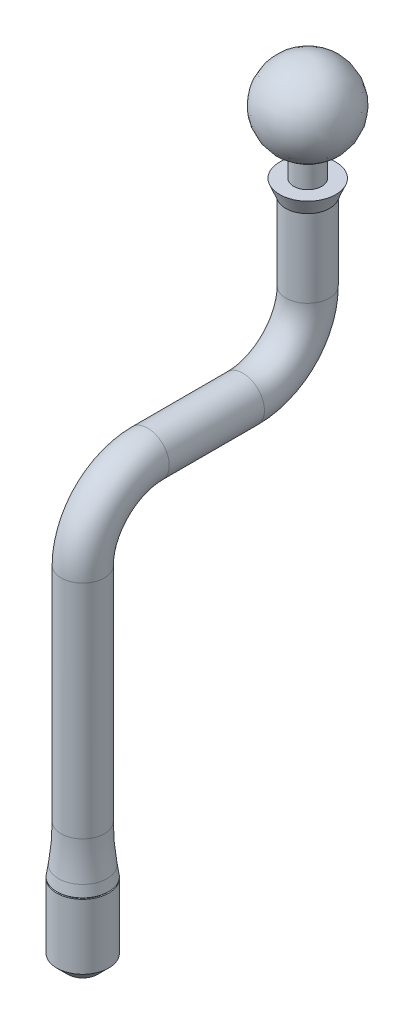
ISO-10303-21;
HEADER;
FILE_DESCRIPTION(('STEP AP214'),'2;1');
FILE_NAME('part.step','',(''),(''),'','','');
FILE_SCHEMA(('AUTOMOTIVE_DESIGN { 1 0 10303 214 1 1 1 1 }'));
ENDSEC;
DATA;
#1=APPLICATION_CONTEXT('core data for automotive mechanical design processes');
#2=APPLICATION_PROTOCOL_DEFINITION('international standard','automotive_design',2000,#1);
#3=PRODUCT_CONTEXT('',#1,'mechanical');
#4=PRODUCT('Part','Part','',(#3));
#5=PRODUCT_RELATED_PRODUCT_CATEGORY('part','',(#4));
#6=PRODUCT_DEFINITION_FORMATION('','',#4);
#7=PRODUCT_DEFINITION_CONTEXT('part definition',#1,'design');
#8=PRODUCT_DEFINITION('design','',#6,#7);
#9=PRODUCT_DEFINITION_SHAPE('','',#8);
#10=(LENGTH_UNIT() NAMED_UNIT(*) SI_UNIT(.MILLI.,.METRE.));
#11=(NAMED_UNIT(*) PLANE_ANGLE_UNIT() SI_UNIT($,.RADIAN.));
#12=(NAMED_UNIT(*) SI_UNIT($,.STERADIAN.) SOLID_ANGLE_UNIT());
#13=UNCERTAINTY_MEASURE_WITH_UNIT(LENGTH_MEASURE(1.E-05),#10,'distance_accuracy_value','');
#14=(GEOMETRIC_REPRESENTATION_CONTEXT(3) GLOBAL_UNCERTAINTY_ASSIGNED_CONTEXT((#13)) GLOBAL_UNIT_ASSIGNED_CONTEXT((#10,
#11,#12)) REPRESENTATION_CONTEXT('',''));
#15=CARTESIAN_POINT('',(0.,0.,0.));
#16=DIRECTION('',(0.,0.,1.));
#17=DIRECTION('',(1.,0.,0.));
#18=AXIS2_PLACEMENT_3D('',#15,#16,#17);
#19=CARTESIAN_POINT('',(0.,18.,0.));
#20=DIRECTION('',(0.,-1.,0.));
#21=DIRECTION('',(0.,0.,-1.));
#22=AXIS2_PLACEMENT_3D('',#19,#20,#21);
#23=PLANE('',#22);
#24=CARTESIAN_POINT('',(0.,18.,0.));
#25=DIRECTION('',(0.,-1.,0.));
#26=DIRECTION('',(0.,0.,-1.));
#27=AXIS2_PLACEMENT_3D('',#24,#25,#26);
#28=CIRCLE('',#27,2.);
#29=CARTESIAN_POINT('',(0.,18.,-2.00000000000003));
#30=VERTEX_POINT('',#29);
#31=EDGE_CURVE('E237',#30,#30,#28,.T.);
#32=ORIENTED_EDGE('',*,*,#31,.T.);
#33=EDGE_LOOP('',(#32));
#34=FACE_BOUND('',#33,.T.);
#35=ADVANCED_FACE('F51',(#34),#23,.T.);
#36=CARTESIAN_POINT('',(0.,18.,0.));
#37=DIRECTION('',(0.,-1.,0.));
#38=DIRECTION('',(0.,0.,-1.));
#39=AXIS2_PLACEMENT_3D('',#36,#37,#38);
#40=CYLINDRICAL_SURFACE('',#39,2.);
#41=CARTESIAN_POINT('',(0.,0.,0.));
#42=DIRECTION('',(0.,-1.,0.));
#43=DIRECTION('',(0.,0.,-1.));
#44=AXIS2_PLACEMENT_3D('',#41,#42,#43);
#45=CIRCLE('',#44,2.);
#46=CARTESIAN_POINT('',(0.,0.,-2.00000000000002));
#47=VERTEX_POINT('',#46);
#48=EDGE_CURVE('E245',#47,#47,#45,.T.);
#49=ORIENTED_EDGE('',*,*,#48,.T.);
#50=EDGE_LOOP('',(#49));
#51=FACE_BOUND('',#50,.T.);
#52=ORIENTED_EDGE('',*,*,#31,.F.);
#53=EDGE_LOOP('',(#52));
#54=FACE_BOUND('',#53,.T.);
#55=ADVANCED_FACE('F210',(#51,#54),#40,.F.);
#56=CARTESIAN_POINT('',(0.,0.,15.));
#57=DIRECTION('',(-1.,0.,0.));
#58=DIRECTION('',(0.,0.,1.));
#59=AXIS2_PLACEMENT_3D('',#56,#57,#58);
#60=TOROIDAL_SURFACE('',#59,15.,2.);
#61=CARTESIAN_POINT('',(0.,-15.,15.));
#62=DIRECTION('',(0.,0.,1.));
#63=DIRECTION('',(0.,-1.,0.));
#64=AXIS2_PLACEMENT_3D('',#61,#62,#63);
#65=CIRCLE('',#64,2.);
#66=CARTESIAN_POINT('',(0.,-17.,15.));
#67=VERTEX_POINT('',#66);
#68=EDGE_CURVE('E242',#67,#67,#65,.T.);
#69=CARTESIAN_POINT('',(0.,0.,15.));
#70=DIRECTION('',(-1.,0.,0.));
#71=DIRECTION('',(0.,0.,1.));
#72=AXIS2_PLACEMENT_3D('',#69,#70,#71);
#73=CIRCLE('',#72,17.);
#74=EDGE_CURVE('',#47,#67,#73,.T.);
#75=ORIENTED_EDGE('',*,*,#48,.F.);
#76=ORIENTED_EDGE('',*,*,#68,.T.);
#77=ORIENTED_EDGE('',*,*,#74,.T.);
#78=ORIENTED_EDGE('',*,*,#74,.F.);
#79=EDGE_LOOP('',(#75,#77,#76,#78));
#80=FACE_BOUND('',#79,.T.);
#81=ADVANCED_FACE('F330',(#80),#60,.F.);
#82=CARTESIAN_POINT('',(0.,-15.,15.));
#83=DIRECTION('',(0.,0.,1.));
#84=DIRECTION('',(1.,0.,0.));
#85=AXIS2_PLACEMENT_3D('',#82,#83,#84);
#86=CYLINDRICAL_SURFACE('',#85,2.);
#87=CARTESIAN_POINT('',(0.,-15.,37.));
#88=DIRECTION('',(0.,0.,1.));
#89=DIRECTION('',(0.,-1.,0.));
#90=AXIS2_PLACEMENT_3D('',#87,#88,#89);
#91=CIRCLE('',#90,2.);
#92=CARTESIAN_POINT('',(0.,-13.,37.));
#93=VERTEX_POINT('',#92);
#94=EDGE_CURVE('E233',#93,#93,#91,.T.);
#95=ORIENTED_EDGE('',*,*,#94,.T.);
#96=EDGE_LOOP('',(#95));
#97=FACE_BOUND('',#96,.T.);
#98=ORIENTED_EDGE('',*,*,#68,.F.);
#99=EDGE_LOOP('',(#98));
#100=FACE_BOUND('',#99,.T.);
#101=ADVANCED_FACE('F201',(#97,#100),#86,.F.);
#102=CARTESIAN_POINT('',(0.,-30.,37.));
#103=DIRECTION('',(1.,0.,0.));
#104=DIRECTION('',(0.,0.,-1.));
#105=AXIS2_PLACEMENT_3D('',#102,#103,#104);
#106=TOROIDAL_SURFACE('',#105,15.,2.);
#107=CARTESIAN_POINT('',(0.,-30.,52.));
#108=DIRECTION('',(0.,-1.,0.));
#109=DIRECTION('',(0.,0.,-1.));
#110=AXIS2_PLACEMENT_3D('',#107,#108,#109);
#111=CIRCLE('',#110,2.);
#112=CARTESIAN_POINT('',(0.,-30.,54.));
#113=VERTEX_POINT('',#112);
#114=EDGE_CURVE('E229',#113,#113,#111,.T.);
#115=CARTESIAN_POINT('',(0.,-30.,37.));
#116=DIRECTION('',(1.,0.,0.));
#117=DIRECTION('',(0.,0.,-1.));
#118=AXIS2_PLACEMENT_3D('',#115,#116,#117);
#119=CIRCLE('',#118,17.);
#120=EDGE_CURVE('',#93,#113,#119,.T.);
#121=ORIENTED_EDGE('',*,*,#94,.F.);
#122=ORIENTED_EDGE('',*,*,#114,.T.);
#123=ORIENTED_EDGE('',*,*,#120,.T.);
#124=ORIENTED_EDGE('',*,*,#120,.F.);
#125=EDGE_LOOP('',(#121,#123,#122,#124));
#126=FACE_BOUND('',#125,.T.);
#127=ADVANCED_FACE('F191',(#126),#106,.F.);
#128=CARTESIAN_POINT('',(0.,-30.,52.));
#129=DIRECTION('',(0.,-1.,0.));
#130=DIRECTION('',(0.,0.,-1.));
#131=AXIS2_PLACEMENT_3D('',#128,#129,#130);
#132=CYLINDRICAL_SURFACE('',#131,2.);
#133=CARTESIAN_POINT('',(0.,-92.3,52.));
#134=DIRECTION('',(0.,-1.,0.));
#135=DIRECTION('',(0.,0.,-1.));
#136=AXIS2_PLACEMENT_3D('',#133,#134,#135);
#137=CIRCLE('',#136,2.);
#138=CARTESIAN_POINT('',(0.,-92.3,50.));
#139=VERTEX_POINT('',#138);
#140=EDGE_CURVE('E236',#139,#139,#137,.T.);
#141=ORIENTED_EDGE('',*,*,#140,.T.);
#142=EDGE_LOOP('',(#141));
#143=FACE_BOUND('',#142,.T.);
#144=ORIENTED_EDGE('',*,*,#114,.F.);
#145=EDGE_LOOP('',(#144));
#146=FACE_BOUND('',#145,.T.);
#147=ADVANCED_FACE('F188',(#143,#146),#132,.F.);
#148=CARTESIAN_POINT('',(0.,-92.3,52.));
#149=DIRECTION('',(0.,1.,0.));
#150=DIRECTION('',(0.,0.,1.));
#151=AXIS2_PLACEMENT_3D('',#148,#149,#150);
#152=PLANE('',#151);
#153=CARTESIAN_POINT('',(0.,-92.3,52.));
#154=DIRECTION('',(0.,-1.,0.));
#155=DIRECTION('',(0.,0.,-1.));
#156=AXIS2_PLACEMENT_3D('',#153,#154,#155);
#157=CIRCLE('',#156,2.73052333998283);
#158=CARTESIAN_POINT('',(0.,-92.3,49.2694766600171));
#159=VERTEX_POINT('',#158);
#160=EDGE_CURVE('E238',#159,#159,#157,.T.);
#161=ORIENTED_EDGE('',*,*,#160,.T.);
#162=EDGE_LOOP('',(#161));
#163=FACE_BOUND('',#162,.T.);
#164=ORIENTED_EDGE('',*,*,#140,.F.);
#165=EDGE_LOOP('',(#164));
#166=FACE_BOUND('',#165,.T.);
#167=ADVANCED_FACE('F190',(#163,#166),#152,.F.);
#168=CARTESIAN_POINT('',(0.,-110.1,52.));
#169=DIRECTION('',(0.,-1.,0.));
#170=DIRECTION('',(0.,0.,-1.));
#171=AXIS2_PLACEMENT_3D('',#168,#169,#170);
#172=CYLINDRICAL_SURFACE('',#171,2.73052333998283);
#173=ORIENTED_EDGE('',*,*,#160,.F.);
#174=EDGE_LOOP('',(#173));
#175=FACE_BOUND('',#174,.T.);
#176=CARTESIAN_POINT('',(0.,-95.7274244285848,52.));
#177=DIRECTION('',(0.,-1.,0.));
#178=DIRECTION('',(0.,0.,-1.));
#179=AXIS2_PLACEMENT_3D('',#176,#177,#178);
#180=CIRCLE('',#179,2.73052333998283);
#181=CARTESIAN_POINT('',(0.,-95.7274244285848,49.2694766600171));
#182=VERTEX_POINT('',#181);
#183=EDGE_CURVE('E252',#182,#182,#180,.T.);
#184=ORIENTED_EDGE('',*,*,#183,.T.);
#185=EDGE_LOOP('',(#184));
#186=FACE_BOUND('',#185,.T.);
#187=ADVANCED_FACE('F198',(#175,#186),#172,.F.);
#188=CARTESIAN_POINT('',(0.,-95.7274244285848,49.2694766600171));
#189=DIRECTION('',(0.,1.,0.));
#190=DIRECTION('',(0.,0.,1.));
#191=AXIS2_PLACEMENT_3D('',#188,#189,#190);
#192=PLANE('',#191);
#193=ORIENTED_EDGE('',*,*,#183,.F.);
#194=EDGE_LOOP('',(#193));
#195=FACE_BOUND('',#194,.T.);
#196=CARTESIAN_POINT('',(0.,-95.7274244285848,52.));
#197=DIRECTION('',(0.,-1.,0.));
#198=DIRECTION('',(0.,0.,-1.));
#199=AXIS2_PLACEMENT_3D('',#196,#197,#198);
#200=CIRCLE('',#199,5.19254816156816);
#201=CARTESIAN_POINT('',(0.,-95.7274244285848,46.8074518384318));
#202=VERTEX_POINT('',#201);
#203=EDGE_CURVE('E255',#202,#202,#200,.T.);
#204=ORIENTED_EDGE('',*,*,#203,.T.);
#205=EDGE_LOOP('',(#204));
#206=FACE_BOUND('',#205,.T.);
#207=ADVANCED_FACE('F373',(#195,#206),#192,.F.);
#208=CARTESIAN_POINT('',(0.,-110.1,52.));
#209=DIRECTION('',(0.,-1.,0.));
#210=DIRECTION('',(0.,0.,-1.));
#211=AXIS2_PLACEMENT_3D('',#208,#209,#210);
#212=CYLINDRICAL_SURFACE('',#211,5.19254816156816);
#213=ORIENTED_EDGE('',*,*,#203,.F.);
#214=EDGE_LOOP('',(#213));
#215=FACE_BOUND('',#214,.T.);
#216=CARTESIAN_POINT('',(0.,-107.137770340873,52.));
#217=DIRECTION('',(0.,-1.,0.));
#218=DIRECTION('',(0.,0.,-1.));
#219=AXIS2_PLACEMENT_3D('',#216,#217,#218);
#220=CIRCLE('',#219,5.19254816156816);
#221=CARTESIAN_POINT('',(0.,-107.137770340873,46.8074518384318));
#222=VERTEX_POINT('',#221);
#223=EDGE_CURVE('E258',#222,#222,#220,.T.);
#224=ORIENTED_EDGE('',*,*,#223,.T.);
#225=EDGE_LOOP('',(#224));
#226=FACE_BOUND('',#225,.T.);
#227=ADVANCED_FACE('F383',(#215,#226),#212,.F.);
#228=CARTESIAN_POINT('',(0.,-109.670285322917,52.));
#229=DIRECTION('',(0.,1.,0.));
#230=DIRECTION('',(0.,0.,1.));
#231=AXIS2_PLACEMENT_3D('',#228,#229,#230);
#232=CONICAL_SURFACE('',#231,2.66003317952349,0.785398163397447);
#233=ORIENTED_EDGE('',*,*,#223,.F.);
#234=EDGE_LOOP('',(#233));
#235=FACE_BOUND('',#234,.T.);
#236=CARTESIAN_POINT('',(0.,-109.670285322917,52.));
#237=DIRECTION('',(0.,-1.,0.));
#238=DIRECTION('',(0.,0.,-1.));
#239=AXIS2_PLACEMENT_3D('',#236,#237,#238);
#240=CIRCLE('',#239,2.66003317952349);
#241=CARTESIAN_POINT('',(0.,-109.670285322917,49.3399668204765));
#242=VERTEX_POINT('',#241);
#243=EDGE_CURVE('E261',#242,#242,#240,.T.);
#244=ORIENTED_EDGE('',*,*,#243,.T.);
#245=EDGE_LOOP('',(#244));
#246=FACE_BOUND('',#245,.T.);
#247=ADVANCED_FACE('F393',(#235,#246),#232,.F.);
#248=CARTESIAN_POINT('',(0.,-109.670285322917,49.3399668204765));
#249=DIRECTION('',(0.,-1.,0.));
#250=DIRECTION('',(0.,0.,-1.));
#251=AXIS2_PLACEMENT_3D('',#248,#249,#250);
#252=PLANE('',#251);
#253=ORIENTED_EDGE('',*,*,#243,.F.);
#254=EDGE_LOOP('',(#253));
#255=FACE_BOUND('',#254,.T.);
#256=CARTESIAN_POINT('',(0.,-109.670285322917,52.));
#257=DIRECTION('',(0.,-1.,0.));
#258=DIRECTION('',(0.,0.,-1.));
#259=AXIS2_PLACEMENT_3D('',#256,#257,#258);
#260=CIRCLE('',#259,0.750000000000001);
#261=CARTESIAN_POINT('',(0.,-109.670285322917,51.25));
#262=VERTEX_POINT('',#261);
#263=EDGE_CURVE('E264',#262,#262,#260,.T.);
#264=ORIENTED_EDGE('',*,*,#263,.T.);
#265=EDGE_LOOP('',(#264));
#266=FACE_BOUND('',#265,.T.);
#267=ADVANCED_FACE('F403',(#255,#266),#252,.F.);
#268=CARTESIAN_POINT('',(0.,-110.1,52.));
#269=DIRECTION('',(0.,-1.,0.));
#270=DIRECTION('',(0.,0.,-1.));
#271=AXIS2_PLACEMENT_3D('',#268,#269,#270);
#272=CYLINDRICAL_SURFACE('',#271,0.750000000000001);
#273=ORIENTED_EDGE('',*,*,#263,.F.);
#274=EDGE_LOOP('',(#273));
#275=FACE_BOUND('',#274,.T.);
#276=CARTESIAN_POINT('',(0.,-110.1,52.));
#277=DIRECTION('',(0.,-1.,0.));
#278=DIRECTION('',(0.,0.,-1.));
#279=AXIS2_PLACEMENT_3D('',#276,#277,#278);
#280=CIRCLE('',#279,0.750000000000001);
#281=CARTESIAN_POINT('',(0.,-110.1,51.25));
#282=VERTEX_POINT('',#281);
#283=EDGE_CURVE('E267',#282,#282,#280,.T.);
#284=ORIENTED_EDGE('',*,*,#283,.T.);
#285=EDGE_LOOP('',(#284));
#286=FACE_BOUND('',#285,.T.);
#287=ADVANCED_FACE('F271',(#275,#286),#272,.F.);
#288=CARTESIAN_POINT('',(0.,18.,0.));
#289=DIRECTION('',(0.,-1.,0.));
#290=DIRECTION('',(0.,0.,-1.));
#291=AXIS2_PLACEMENT_3D('',#288,#289,#290);
#292=CYLINDRICAL_SURFACE('',#291,5.);
#293=CARTESIAN_POINT('',(0.,0.,0.));
#294=DIRECTION('',(0.,1.,0.));
#295=DIRECTION('',(0.,0.,1.));
#296=AXIS2_PLACEMENT_3D('',#293,#294,#295);
#297=CIRCLE('',#296,5.);
#298=CARTESIAN_POINT('',(0.,0.,-5.));
#299=VERTEX_POINT('',#298);
#300=EDGE_CURVE('E162',#299,#299,#297,.T.);
#301=ORIENTED_EDGE('',*,*,#300,.T.);
#302=EDGE_LOOP('',(#301));
#303=FACE_BOUND('',#302,.T.);
#304=CARTESIAN_POINT('',(0.,18.,0.));
#305=DIRECTION('',(0.,1.,0.));
#306=DIRECTION('',(0.,0.,1.));
#307=AXIS2_PLACEMENT_3D('',#304,#305,#306);
#308=CIRCLE('',#307,5.);
#309=CARTESIAN_POINT('',(0.,18.,4.99999999999999));
#310=VERTEX_POINT('',#309);
#311=EDGE_CURVE('E156',#310,#310,#308,.T.);
#312=ORIENTED_EDGE('',*,*,#311,.F.);
#313=EDGE_LOOP('',(#312));
#314=FACE_BOUND('',#313,.T.);
#315=ADVANCED_FACE('F420',(#303,#314),#292,.T.);
#316=CARTESIAN_POINT('',(0.,0.,15.));
#317=DIRECTION('',(-1.,0.,0.));
#318=DIRECTION('',(0.,0.,1.));
#319=AXIS2_PLACEMENT_3D('',#316,#317,#318);
#320=TOROIDAL_SURFACE('',#319,15.,5.);
#321=CARTESIAN_POINT('',(0.,-15.,15.));
#322=DIRECTION('',(0.,0.,-1.));
#323=DIRECTION('',(0.,1.,0.));
#324=AXIS2_PLACEMENT_3D('',#321,#322,#323);
#325=CIRCLE('',#324,5.);
#326=CARTESIAN_POINT('',(0.,-20.,15.));
#327=VERTEX_POINT('',#326);
#328=EDGE_CURVE('E165',#327,#327,#325,.T.);
#329=CARTESIAN_POINT('',(0.,0.,15.));
#330=DIRECTION('',(-1.,0.,0.));
#331=DIRECTION('',(0.,0.,1.));
#332=AXIS2_PLACEMENT_3D('',#329,#330,#331);
#333=CIRCLE('',#332,20.);
#334=EDGE_CURVE('',#299,#327,#333,.T.);
#335=ORIENTED_EDGE('',*,*,#300,.F.);
#336=ORIENTED_EDGE('',*,*,#328,.T.);
#337=ORIENTED_EDGE('',*,*,#334,.T.);
#338=ORIENTED_EDGE('',*,*,#334,.F.);
#339=EDGE_LOOP('',(#335,#337,#336,#338));
#340=FACE_BOUND('',#339,.T.);
#341=ADVANCED_FACE('F430',(#340),#320,.T.);
#342=CARTESIAN_POINT('',(0.,-15.,15.));
#343=DIRECTION('',(0.,0.,1.));
#344=DIRECTION('',(1.,0.,0.));
#345=AXIS2_PLACEMENT_3D('',#342,#343,#344);
#346=CYLINDRICAL_SURFACE('',#345,5.);
#347=CARTESIAN_POINT('',(0.,-15.,37.));
#348=DIRECTION('',(0.,0.,-1.));
#349=DIRECTION('',(0.,1.,0.));
#350=AXIS2_PLACEMENT_3D('',#347,#348,#349);
#351=CIRCLE('',#350,5.);
#352=CARTESIAN_POINT('',(0.,-10.,37.));
#353=VERTEX_POINT('',#352);
#354=EDGE_CURVE('E168',#353,#353,#351,.T.);
#355=ORIENTED_EDGE('',*,*,#354,.T.);
#356=EDGE_LOOP('',(#355));
#357=FACE_BOUND('',#356,.T.);
#358=ORIENTED_EDGE('',*,*,#328,.F.);
#359=EDGE_LOOP('',(#358));
#360=FACE_BOUND('',#359,.T.);
#361=ADVANCED_FACE('F437',(#357,#360),#346,.T.);
#362=CARTESIAN_POINT('',(0.,-30.,37.));
#363=DIRECTION('',(1.,0.,0.));
#364=DIRECTION('',(0.,0.,-1.));
#365=AXIS2_PLACEMENT_3D('',#362,#363,#364);
#366=TOROIDAL_SURFACE('',#365,15.,5.);
#367=CARTESIAN_POINT('',(0.,-30.,52.));
#368=DIRECTION('',(0.,1.,0.));
#369=DIRECTION('',(0.,0.,1.));
#370=AXIS2_PLACEMENT_3D('',#367,#368,#369);
#371=CIRCLE('',#370,5.);
#372=CARTESIAN_POINT('',(0.,-30.,57.));
#373=VERTEX_POINT('',#372);
#374=EDGE_CURVE('E171',#373,#373,#371,.T.);
#375=CARTESIAN_POINT('',(0.,-30.,37.));
#376=DIRECTION('',(1.,0.,0.));
#377=DIRECTION('',(0.,0.,-1.));
#378=AXIS2_PLACEMENT_3D('',#375,#376,#377);
#379=CIRCLE('',#378,20.);
#380=EDGE_CURVE('',#353,#373,#379,.T.);
#381=ORIENTED_EDGE('',*,*,#354,.F.);
#382=ORIENTED_EDGE('',*,*,#374,.T.);
#383=ORIENTED_EDGE('',*,*,#380,.T.);
#384=ORIENTED_EDGE('',*,*,#380,.F.);
#385=EDGE_LOOP('',(#381,#383,#382,#384));
#386=FACE_BOUND('',#385,.T.);
#387=ADVANCED_FACE('F445',(#386),#366,.T.);
#388=CARTESIAN_POINT('',(0.,-30.,52.));
#389=DIRECTION('',(0.,-1.,0.));
#390=DIRECTION('',(0.,0.,-1.));
#391=AXIS2_PLACEMENT_3D('',#388,#389,#390);
#392=CYLINDRICAL_SURFACE('',#391,5.);
#393=CARTESIAN_POINT('',(0.,-81.2074927859557,52.));
#394=DIRECTION('',(0.,-1.,0.));
#395=DIRECTION('',(0.,0.,-1.));
#396=AXIS2_PLACEMENT_3D('',#393,#394,#395);
#397=CIRCLE('',#396,5.);
#398=CARTESIAN_POINT('',(0.,-81.2074927859557,47.));
#399=VERTEX_POINT('',#398);
#400=EDGE_CURVE('E59',#399,#399,#397,.F.);
#401=ORIENTED_EDGE('',*,*,#400,.T.);
#402=EDGE_LOOP('',(#401));
#403=FACE_BOUND('',#402,.T.);
#404=ORIENTED_EDGE('',*,*,#374,.F.);
#405=EDGE_LOOP('',(#404));
#406=FACE_BOUND('',#405,.T.);
#407=ADVANCED_FACE('F179',(#403,#406),#392,.T.);
#408=CARTESIAN_POINT('',(0.,-92.3,52.));
#409=DIRECTION('',(0.,-1.,0.));
#410=DIRECTION('',(0.,0.,-1.));
#411=AXIS2_PLACEMENT_3D('',#408,#409,#410);
#412=PLANE('',#411);
#413=CARTESIAN_POINT('',(0.,-92.3,52.));
#414=DIRECTION('',(0.,-1.,0.));
#415=DIRECTION('',(0.,0.,-1.));
#416=AXIS2_PLACEMENT_3D('',#413,#414,#415);
#417=CIRCLE('',#416,5.7);
#418=CARTESIAN_POINT('',(0.,-92.3,46.3));
#419=VERTEX_POINT('',#418);
#420=EDGE_CURVE('E12',#419,#419,#417,.T.);
#421=ORIENTED_EDGE('',*,*,#420,.F.);
#422=EDGE_LOOP('',(#421));
#423=FACE_BOUND('',#422,.T.);
#424=CARTESIAN_POINT('',(0.,-92.3,52.));
#425=DIRECTION('',(0.,-1.,0.));
#426=DIRECTION('',(0.,0.,-1.));
#427=AXIS2_PLACEMENT_3D('',#424,#425,#426);
#428=CIRCLE('',#427,6.);
#429=CARTESIAN_POINT('',(1.52050741507945,-92.3,46.1958586164112));
#430=VERTEX_POINT('',#429);
#431=EDGE_CURVE('E146',#430,#430,#428,.T.);
#432=ORIENTED_EDGE('',*,*,#431,.T.);
#433=EDGE_LOOP('',(#432));
#434=FACE_BOUND('',#433,.T.);
#435=ADVANCED_FACE('F123',(#423,#434),#412,.T.);
#436=CARTESIAN_POINT('',(0.,-85.,47.));
#437=CARTESIAN_POINT('',(1.52050741507945,-92.3,46.1958586164112));
#438=CARTESIAN_POINT('',(10.,-85.,47.));
#439=CARTESIAN_POINT('',(13.1287901822571,-92.3,49.2368734465701));
#440=CARTESIAN_POINT('',(10.,-85.,57.));
#441=CARTESIAN_POINT('',(10.0877753520982,-92.3,60.8451562137477));
#442=CARTESIAN_POINT('',(0.,-85.,57.));
#443=CARTESIAN_POINT('',(-1.52050741507945,-92.3,57.8041413835888));
#444=CARTESIAN_POINT('',(-10.,-85.,57.));
#445=CARTESIAN_POINT('',(-13.1287901822571,-92.3,54.7631265534299));
#446=CARTESIAN_POINT('',(-10.,-85.,47.));
#447=CARTESIAN_POINT('',(-10.0877753520982,-92.3,43.1548437862522));
#448=CARTESIAN_POINT('',(0.,-85.,47.));
#449=CARTESIAN_POINT('',(1.52050741507945,-92.3,46.1958586164112));
#450=(BOUNDED_SURFACE() B_SPLINE_SURFACE(3,1,((#436,#437),(#438,#439),(#440,#441),(#442,#443),
(#444,#445),(#446,#447),(#448,#449)),.UNSPECIFIED.,.T.,.F.,.F.) B_SPLINE_SURFACE_WITH_KNOTS((4,
3,4),(2,2),(0.,0.5,1.),(0.,1.),
.UNSPECIFIED.) GEOMETRIC_REPRESENTATION_ITEM() RATIONAL_B_SPLINE_SURFACE(((1.,1.),
(0.333333333333333,0.333333333333333),(0.333333333333333,0.333333333333333),(1.,1.),
(0.333333333333333,0.333333333333333),(0.333333333333333,0.333333333333333),(1.,1.))) REPRESENTATION_ITEM('') SURFACE());
#451=CARTESIAN_POINT('',(0.,-89.8687351518546,52.));
#452=DIRECTION('',(0.,-1.,0.));
#453=DIRECTION('',(0.,0.,-1.));
#454=AXIS2_PLACEMENT_3D('',#451,#452,#453);
#455=CIRCLE('',#454,5.62843373567481);
#456=CARTESIAN_POINT('',(1.01410245211684,-89.8687351518546,46.4636778874877));
#457=VERTEX_POINT('',#456);
#458=EDGE_CURVE('E174',#457,#457,#455,.T.);
#459=CARTESIAN_POINT('',(1.01410245211684,-89.8687351518546,46.4636778874877));
#460=CARTESIAN_POINT('',(1.01937750381436,-89.8940608273561,46.4608881034139));
#461=CARTESIAN_POINT('',(1.02465255551189,-89.9193865028576,46.4580983193402));
#462=CARTESIAN_POINT('',(1.03520265890695,-89.9700378538606,46.4525187511928));
#463=CARTESIAN_POINT('',(1.04047771060448,-89.9953635293622,46.4497289671191));
#464=CARTESIAN_POINT('',(1.05102781399953,-90.0460148803652,46.4441493989717));
#465=CARTESIAN_POINT('',(1.05630286569706,-90.0713405558667,46.4413596148979));
#466=CARTESIAN_POINT('',(1.06685296909211,-90.1219919068697,46.4357800467505));
#467=CARTESIAN_POINT('',(1.07212802078964,-90.1473175823713,46.4329902626768));
#468=CARTESIAN_POINT('',(1.08267812418469,-90.1979689333743,46.4274106945294));
#469=CARTESIAN_POINT('',(1.08795317588222,-90.2232946088758,46.4246209104557));
#470=CARTESIAN_POINT('',(1.09850327927727,-90.2739459598788,46.4190413423082));
#471=CARTESIAN_POINT('',(1.1037783309748,-90.2992716353804,46.4162515582345));
#472=CARTESIAN_POINT('',(1.11432843436986,-90.3499229863834,46.4106719900871));
#473=CARTESIAN_POINT('',(1.11960348606738,-90.3752486618849,46.4078822060134));
#474=CARTESIAN_POINT('',(1.13015358946244,-90.4259000128879,46.402302637866));
#475=CARTESIAN_POINT('',(1.13542864115997,-90.4512256883894,46.3995128537922));
#476=CARTESIAN_POINT('',(1.14597874455502,-90.5018770393925,46.3939332856448));
#477=CARTESIAN_POINT('',(1.15125379625255,-90.527202714894,46.3911435015711));
#478=CARTESIAN_POINT('',(1.1618038996476,-90.577854065897,46.3855639334237));
#479=CARTESIAN_POINT('',(1.16707895134513,-90.6031797413985,46.38277414935));
#480=CARTESIAN_POINT('',(1.17762905474018,-90.6538310924015,46.3771945812025));
#481=CARTESIAN_POINT('',(1.18290410643771,-90.6791567679031,46.3744047971288));
#482=CARTESIAN_POINT('',(1.19345420983277,-90.7298081189061,46.3688252289814));
#483=CARTESIAN_POINT('',(1.19872926153029,-90.7551337944076,46.3660354449077));
#484=CARTESIAN_POINT('',(1.20927936492535,-90.8057851454106,46.3604558767603));
#485=CARTESIAN_POINT('',(1.21455441662287,-90.8311108209121,46.3576660926865));
#486=CARTESIAN_POINT('',(1.22510452001793,-90.8817621719152,46.3520865245391));
#487=CARTESIAN_POINT('',(1.23037957171546,-90.9070878474167,46.3492967404654));
#488=CARTESIAN_POINT('',(1.24092967511051,-90.9577391984197,46.343717172318));
#489=CARTESIAN_POINT('',(1.24620472680804,-90.9830648739212,46.3409273882443));
#490=CARTESIAN_POINT('',(1.25675483020309,-91.0337162249243,46.3353478200968));
#491=CARTESIAN_POINT('',(1.26202988190062,-91.0590419004258,46.3325580360231));
#492=CARTESIAN_POINT('',(1.27257998529567,-91.1096932514288,46.3269784678757));
#493=CARTESIAN_POINT('',(1.2778550369932,-91.1350189269303,46.324188683802));
#494=CARTESIAN_POINT('',(1.28840514038826,-91.1856702779334,46.3186091156545));
#495=CARTESIAN_POINT('',(1.29368019208578,-91.2109959534349,46.3158193315808));
#496=CARTESIAN_POINT('',(1.30423029548084,-91.2616473044379,46.3102397634334));
#497=CARTESIAN_POINT('',(1.30950534717836,-91.2869729799394,46.3074499793597));
#498=CARTESIAN_POINT('',(1.32005545057342,-91.3376243309424,46.3018704112123));
#499=CARTESIAN_POINT('',(1.32533050227095,-91.362950006444,46.2990806271386));
#500=CARTESIAN_POINT('',(1.335880605666,-91.413601357447,46.2935010589911));
#501=CARTESIAN_POINT('',(1.34115565736353,-91.4389270329485,46.2907112749174));
#502=CARTESIAN_POINT('',(1.35170576075858,-91.4895783839515,46.28513170677));
#503=CARTESIAN_POINT('',(1.35698081245611,-91.514904059453,46.2823419226963));
#504=CARTESIAN_POINT('',(1.36753091585116,-91.5655554104561,46.2767623545489));
#505=CARTESIAN_POINT('',(1.37280596754869,-91.5908810859576,46.2739725704751));
#506=CARTESIAN_POINT('',(1.38335607094375,-91.6415324369606,46.2683930023277));
#507=CARTESIAN_POINT('',(1.38863112264127,-91.6668581124621,46.265603218254));
#508=CARTESIAN_POINT('',(1.39918122603633,-91.7175094634652,46.2600236501066));
#509=CARTESIAN_POINT('',(1.40445627773386,-91.7428351389667,46.2572338660328));
#510=CARTESIAN_POINT('',(1.41500638112891,-91.7934864899697,46.2516542978854));
#511=CARTESIAN_POINT('',(1.42028143282644,-91.8188121654712,46.2488645138117));
#512=CARTESIAN_POINT('',(1.43083153622149,-91.8694635164743,46.2432849456643));
#513=CARTESIAN_POINT('',(1.43610658791902,-91.8947891919758,46.2404951615906));
#514=CARTESIAN_POINT('',(1.44665669131407,-91.9454405429788,46.2349155934431));
#515=CARTESIAN_POINT('',(1.4519317430116,-91.9707662184803,46.2321258093694));
#516=CARTESIAN_POINT('',(1.46248184640665,-92.0214175694833,46.226546241222));
#517=CARTESIAN_POINT('',(1.46775689810418,-92.0467432449849,46.2237564571483));
#518=CARTESIAN_POINT('',(1.47830700149924,-92.0973945959879,46.2181768890009));
#519=CARTESIAN_POINT('',(1.48358205319676,-92.1227202714894,46.2153871049271));
#520=CARTESIAN_POINT('',(1.49413215659182,-92.1733716224924,46.2098075367797));
#521=CARTESIAN_POINT('',(1.49940720828935,-92.1986972979939,46.207017752706));
#522=CARTESIAN_POINT('',(1.5099573116844,-92.249348648997,46.2014381845586));
#523=CARTESIAN_POINT('',(1.51523236338193,-92.2746743244985,46.1986484004849));
#524=CARTESIAN_POINT('',(1.52050741507945,-92.3,46.1958586164112));
#525=B_SPLINE_CURVE_WITH_KNOTS('',3,(#459,#460,#461,#462,#463,#464,#465,#466,#467,#468,#469,
#470,#471,#472,#473,#474,#475,#476,#477,#478,#479,#480,#481,#482,#483,#484,#485,#486,#487,#488,
#489,#490,#491,#492,#493,#494,#495,#496,#497,#498,#499,#500,#501,#502,#503,#504,#505,#506,#507,
#508,#509,#510,#511,#512,#513,#514,#515,#516,#517,#518,#519,#520,#521,#522,#523,#524),
.UNSPECIFIED.,.F.,.F.,(4,2,2,2,2,2,2,2,2,2,2,2,2,2,2,2,2,2,2,2,2,2,2,2,2,2,2,2,2,2,2,2,4),(0.,
0.0780576078725021,0.156115215745004,0.23417282361752,0.312230431490009,0.390288039362537,
0.468345647235026,0.546403255107541,0.624460862980043,0.702518470852545,0.78057607872506,
0.858633686597562,0.936691294470064,1.01474890234257,1.09280651021507,1.17086411808758,
1.24892172596009,1.32697933383259,1.4050369417051,1.48309454957761,1.56115215745011,
1.63920976532261,1.71726737319514,1.79532498106763,1.87338258894014,1.95144019681264,
2.02949780468516,2.10755541255766,2.18561302043016,2.26367062830267,2.34172823617517,
2.41978584404768,2.49784345192018),.UNSPECIFIED.);
#526=EDGE_CURVE('BSEAM117',#457,#430,#525,.T.);
#527=ORIENTED_EDGE('',*,*,#458,.T.);
#528=ORIENTED_EDGE('',*,*,#431,.F.);
#529=ORIENTED_EDGE('',*,*,#526,.T.);
#530=ORIENTED_EDGE('',*,*,#526,.F.);
#531=EDGE_LOOP('',(#527,#529,#528,#530));
#532=FACE_BOUND('',#531,.T.);
#533=ADVANCED_FACE('F117',(#532),#450,.T.);
#534=CARTESIAN_POINT('',(0.,-81.2074927859557,52.));
#535=DIRECTION('',(0.,-1.,0.));
#536=DIRECTION('',(0.,0.,-1.));
#537=AXIS2_PLACEMENT_3D('',#534,#535,#536);
#538=TOROIDAL_SURFACE('',#537,65.,60.);
#539=ORIENTED_EDGE('',*,*,#400,.F.);
#540=EDGE_LOOP('',(#539));
#541=FACE_BOUND('',#540,.T.);
#542=ORIENTED_EDGE('',*,*,#458,.F.);
#543=EDGE_LOOP('',(#542));
#544=FACE_BOUND('',#543,.T.);
#545=ADVANCED_FACE('F53',(#541,#544),#538,.F.);
#546=CARTESIAN_POINT('',(0.,-92.6,52.));
#547=DIRECTION('',(0.,1.,0.));
#548=DIRECTION('',(0.,0.,1.));
#549=AXIS2_PLACEMENT_3D('',#546,#547,#548);
#550=CYLINDRICAL_SURFACE('',#549,5.7);
#551=CARTESIAN_POINT('',(0.,-92.6,52.));
#552=DIRECTION('',(0.,-1.,0.));
#553=DIRECTION('',(0.,0.,-1.));
#554=AXIS2_PLACEMENT_3D('',#551,#552,#553);
#555=CIRCLE('',#554,5.7);
#556=CARTESIAN_POINT('',(0.,-92.6,46.3));
#557=VERTEX_POINT('',#556);
#558=EDGE_CURVE('E157',#557,#557,#555,.T.);
#559=ORIENTED_EDGE('',*,*,#558,.F.);
#560=EDGE_LOOP('',(#559));
#561=FACE_BOUND('',#560,.T.);
#562=ORIENTED_EDGE('',*,*,#420,.T.);
#563=EDGE_LOOP('',(#562));
#564=FACE_BOUND('',#563,.T.);
#565=ADVANCED_FACE('F112',(#561,#564),#550,.T.);
#566=CARTESIAN_POINT('',(0.,-107.6,52.));
#567=DIRECTION('',(0.,1.,0.));
#568=DIRECTION('',(0.,0.,1.));
#569=AXIS2_PLACEMENT_3D('',#566,#567,#568);
#570=CYLINDRICAL_SURFACE('',#569,6.);
#571=CARTESIAN_POINT('',(0.,-107.6,52.));
#572=DIRECTION('',(0.,-1.,0.));
#573=DIRECTION('',(0.,0.,-1.));
#574=AXIS2_PLACEMENT_3D('',#571,#572,#573);
#575=CIRCLE('',#574,6.);
#576=CARTESIAN_POINT('',(0.,-107.6,46.));
#577=VERTEX_POINT('',#576);
#578=EDGE_CURVE('E55',#577,#577,#575,.T.);
#579=ORIENTED_EDGE('',*,*,#578,.F.);
#580=EDGE_LOOP('',(#579));
#581=FACE_BOUND('',#580,.T.);
#582=CARTESIAN_POINT('',(0.,-92.6,52.));
#583=DIRECTION('',(0.,-1.,0.));
#584=DIRECTION('',(0.,0.,-1.));
#585=AXIS2_PLACEMENT_3D('',#582,#583,#584);
#586=CIRCLE('',#585,6.);
#587=CARTESIAN_POINT('',(0.,-92.6,46.));
#588=VERTEX_POINT('',#587);
#589=EDGE_CURVE('E77',#588,#588,#586,.T.);
#590=ORIENTED_EDGE('',*,*,#589,.T.);
#591=EDGE_LOOP('',(#590));
#592=FACE_BOUND('',#591,.T.);
#593=ADVANCED_FACE('F108',(#581,#592),#570,.T.);
#594=CARTESIAN_POINT('',(0.,-92.6,52.));
#595=DIRECTION('',(0.,-1.,0.));
#596=DIRECTION('',(0.,0.,-1.));
#597=AXIS2_PLACEMENT_3D('',#594,#595,#596);
#598=PLANE('',#597);
#599=ORIENTED_EDGE('',*,*,#558,.T.);
#600=EDGE_LOOP('',(#599));
#601=FACE_BOUND('',#600,.T.);
#602=ORIENTED_EDGE('',*,*,#589,.F.);
#603=EDGE_LOOP('',(#602));
#604=FACE_BOUND('',#603,.T.);
#605=ADVANCED_FACE('F105',(#601,#604),#598,.F.);
#606=CARTESIAN_POINT('',(0.,-110.1,52.));
#607=DIRECTION('',(0.,-1.,0.));
#608=DIRECTION('',(0.,0.,-1.));
#609=AXIS2_PLACEMENT_3D('',#606,#607,#608);
#610=PLANE('',#609);
#611=ORIENTED_EDGE('',*,*,#283,.F.);
#612=EDGE_LOOP('',(#611));
#613=FACE_BOUND('',#612,.T.);
#614=CARTESIAN_POINT('',(0.,-110.1,52.));
#615=DIRECTION('',(0.,-1.,0.));
#616=DIRECTION('',(0.,0.,-1.));
#617=AXIS2_PLACEMENT_3D('',#614,#615,#616);
#618=CIRCLE('',#617,3.5);
#619=CARTESIAN_POINT('',(0.,-110.1,48.5));
#620=VERTEX_POINT('',#619);
#621=EDGE_CURVE('E73',#620,#620,#618,.T.);
#622=ORIENTED_EDGE('',*,*,#621,.T.);
#623=EDGE_LOOP('',(#622));
#624=FACE_BOUND('',#623,.T.);
#625=ADVANCED_FACE('F102',(#613,#624),#610,.T.);
#626=CARTESIAN_POINT('',(0.,-110.1,52.));
#627=DIRECTION('',(0.,1.,0.));
#628=DIRECTION('',(0.,0.,1.));
#629=AXIS2_PLACEMENT_3D('',#626,#627,#628);
#630=CONICAL_SURFACE('',#629,3.5,0.785398163397448);
#631=ORIENTED_EDGE('',*,*,#621,.F.);
#632=EDGE_LOOP('',(#631));
#633=FACE_BOUND('',#632,.T.);
#634=ORIENTED_EDGE('',*,*,#578,.T.);
#635=EDGE_LOOP('',(#634));
#636=FACE_BOUND('',#635,.T.);
#637=ADVANCED_FACE('F92',(#633,#636),#630,.T.);
#638=CARTESIAN_POINT('',(0.,0.,0.));
#639=DIRECTION('',(0.,-1.,0.));
#640=DIRECTION('',(0.,0.,-1.));
#641=AXIS2_PLACEMENT_3D('',#638,#639,#640);
#642=CYLINDRICAL_SURFACE('',#641,3.25);
#643=CARTESIAN_POINT('',(0.,27.0589931477557,0.));
#644=DIRECTION('',(0.,-1.,0.));
#645=DIRECTION('',(0.,0.,-1.));
#646=AXIS2_PLACEMENT_3D('',#643,#644,#645);
#647=CIRCLE('',#646,3.25);
#648=CARTESIAN_POINT('',(0.,27.0589931477557,-3.25));
#649=VERTEX_POINT('',#648);
#650=EDGE_CURVE('E71',#649,#649,#647,.T.);
#651=ORIENTED_EDGE('',*,*,#650,.T.);
#652=EDGE_LOOP('',(#651));
#653=FACE_BOUND('',#652,.T.);
#654=CARTESIAN_POINT('',(0.,21.5,0.));
#655=DIRECTION('',(0.,-1.,0.));
#656=DIRECTION('',(0.,0.,-1.));
#657=AXIS2_PLACEMENT_3D('',#654,#655,#656);
#658=CIRCLE('',#657,3.25);
#659=CARTESIAN_POINT('',(0.,21.5,-3.25));
#660=VERTEX_POINT('',#659);
#661=EDGE_CURVE('E228',#660,#660,#658,.T.);
#662=ORIENTED_EDGE('',*,*,#661,.F.);
#663=EDGE_LOOP('',(#662));
#664=FACE_BOUND('',#663,.T.);
#665=ADVANCED_FACE('F67',(#653,#664),#642,.T.);
#666=CARTESIAN_POINT('',(0.,36.1088430613094,-0.399966595735369));
#667=DIRECTION('',(-1.,0.,0.));
#668=DIRECTION('',(0.,0.,-1.));
#669=AXIS2_PLACEMENT_3D('',#666,#667,#668);
#670=CIRCLE('',#669,9.48801738316662);
#671=TRIMMED_CURVE('',#670,(PARAMETER_VALUE(-1.61296374003355)),
(PARAMETER_VALUE(1.61296374003355)),.T.,.PARAMETER.);
#672=CARTESIAN_POINT('',(0.,36.1088430613094,0.));
#673=DIRECTION('',(0.,-1.,0.));
#674=AXIS1_PLACEMENT('',#672,#673);
#675=SURFACE_OF_REVOLUTION('',#671,#674);
#676=CARTESIAN_POINT('',(0.,45.5884264163713,0.));
#677=VERTEX_POINT('',#676);
#678=VERTEX_LOOP('',#677);
#679=FACE_BOUND('',#678,.T.);
#680=ORIENTED_EDGE('',*,*,#650,.F.);
#681=EDGE_LOOP('',(#680));
#682=FACE_BOUND('',#681,.T.);
#683=ADVANCED_FACE('F63',(#679,#682),#675,.T.);
#684=CARTESIAN_POINT('',(0.,18.,0.));
#685=DIRECTION('',(0.,-1.,0.));
#686=DIRECTION('',(0.,0.,-1.));
#687=AXIS2_PLACEMENT_3D('',#684,#685,#686);
#688=PLANE('',#687);
#689=ORIENTED_EDGE('',*,*,#311,.T.);
#690=EDGE_LOOP('',(#689));
#691=FACE_BOUND('',#690,.T.);
#692=CARTESIAN_POINT('',(0.,18.,0.));
#693=DIRECTION('',(0.,-1.,0.));
#694=DIRECTION('',(0.,0.,-1.));
#695=AXIS2_PLACEMENT_3D('',#692,#693,#694);
#696=CIRCLE('',#695,5.07832284417149);
#697=CARTESIAN_POINT('',(0.,18.,-5.07832284417149));
#698=VERTEX_POINT('',#697);
#699=EDGE_CURVE('E74',#698,#698,#696,.T.);
#700=ORIENTED_EDGE('',*,*,#699,.T.);
#701=EDGE_LOOP('',(#700));
#702=FACE_BOUND('',#701,.T.);
#703=ADVANCED_FACE('F66',(#691,#702),#688,.T.);
#704=CARTESIAN_POINT('',(0.,18.,0.));
#705=DIRECTION('',(0.,1.,0.));
#706=DIRECTION('',(0.,0.,1.));
#707=AXIS2_PLACEMENT_3D('',#704,#705,#706);
#708=CONICAL_SURFACE('',#707,5.07832284417149,0.385834149119108);
#709=CARTESIAN_POINT('',(0.,21.5,0.));
#710=DIRECTION('',(0.,-1.,0.));
#711=DIRECTION('',(0.,0.,-1.));
#712=AXIS2_PLACEMENT_3D('',#709,#710,#711);
#713=CIRCLE('',#712,6.5);
#714=CARTESIAN_POINT('',(0.,21.5,-6.5));
#715=VERTEX_POINT('',#714);
#716=EDGE_CURVE('E80',#715,#715,#713,.T.);
#717=ORIENTED_EDGE('',*,*,#716,.T.);
#718=EDGE_LOOP('',(#717));
#719=FACE_BOUND('',#718,.T.);
#720=ORIENTED_EDGE('',*,*,#699,.F.);
#721=EDGE_LOOP('',(#720));
#722=FACE_BOUND('',#721,.T.);
#723=ADVANCED_FACE('F215',(#719,#722),#708,.T.);
#724=CARTESIAN_POINT('',(0.,21.5,-3.25));
#725=DIRECTION('',(0.,1.,0.));
#726=DIRECTION('',(0.,0.,1.));
#727=AXIS2_PLACEMENT_3D('',#724,#725,#726);
#728=PLANE('',#727);
#729=ORIENTED_EDGE('',*,*,#661,.T.);
#730=EDGE_LOOP('',(#729));
#731=FACE_BOUND('',#730,.T.);
#732=ORIENTED_EDGE('',*,*,#716,.F.);
#733=EDGE_LOOP('',(#732));
#734=FACE_BOUND('',#733,.T.);
#735=ADVANCED_FACE('F212',(#731,#734),#728,.T.);
#736=CLOSED_SHELL('',(#35,#55,#81,#101,#127,#147,#167,#187,#207,#227,#247,#267,#287,#315,#341,
#361,#387,#407,#435,#533,#545,#565,#593,#605,#625,#637,#665,#683,#703,#723,#735));
#737=MANIFOLD_SOLID_BREP('B2',#736);
#738=ADVANCED_BREP_SHAPE_REPRESENTATION('',(#18,#737),#14);
#739=SHAPE_DEFINITION_REPRESENTATION(#9,#738);
ENDSEC;
END-ISO-10303-21;
